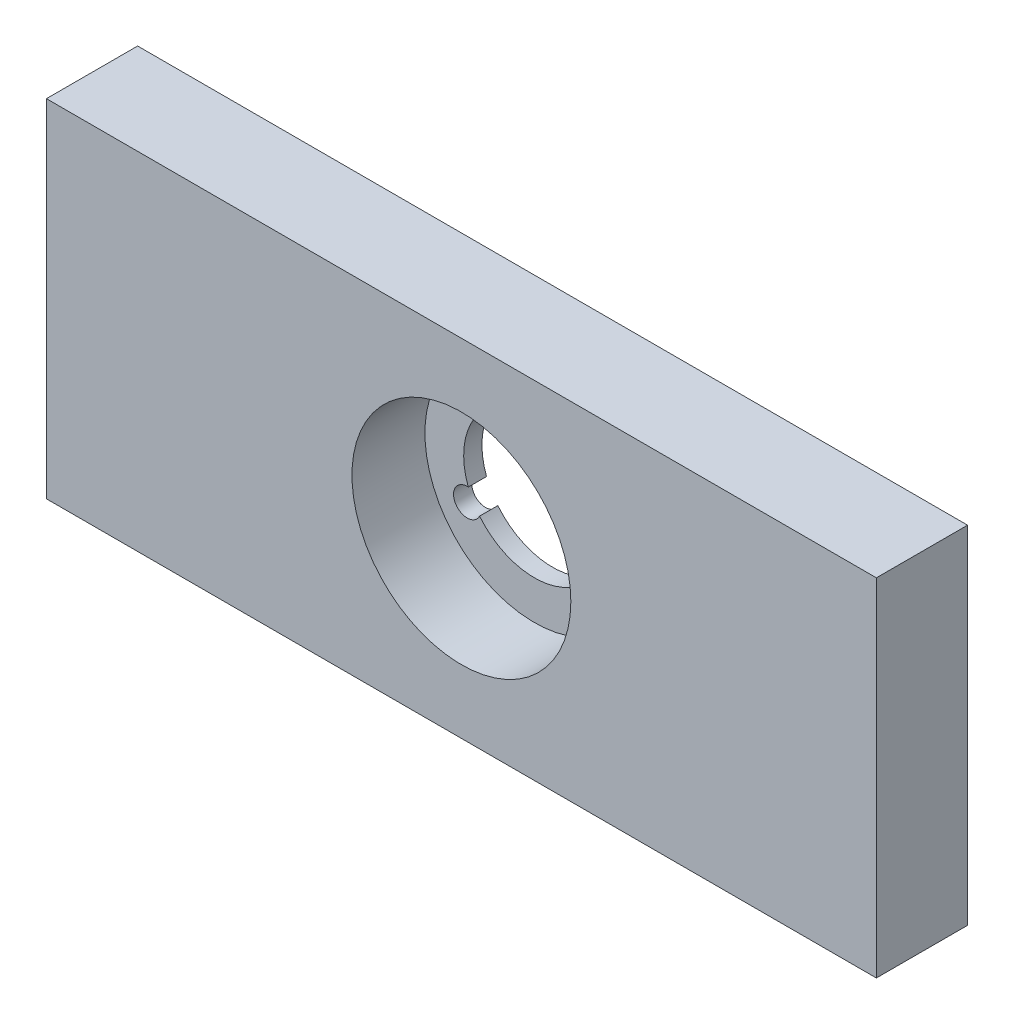
ISO-10303-21;
HEADER;
FILE_DESCRIPTION(('STEP AP214'),'2;1');
FILE_NAME('part.step','',(''),(''),'','','');
FILE_SCHEMA(('AUTOMOTIVE_DESIGN { 1 0 10303 214 1 1 1 1 }'));
ENDSEC;
DATA;
#1=APPLICATION_CONTEXT('core data for automotive mechanical design processes');
#2=APPLICATION_PROTOCOL_DEFINITION('international standard','automotive_design',2000,#1);
#3=PRODUCT_CONTEXT('',#1,'mechanical');
#4=PRODUCT('Part','Part','',(#3));
#5=PRODUCT_RELATED_PRODUCT_CATEGORY('part','',(#4));
#6=PRODUCT_DEFINITION_FORMATION('','',#4);
#7=PRODUCT_DEFINITION_CONTEXT('part definition',#1,'design');
#8=PRODUCT_DEFINITION('design','',#6,#7);
#9=PRODUCT_DEFINITION_SHAPE('','',#8);
#10=(LENGTH_UNIT() NAMED_UNIT(*) SI_UNIT(.MILLI.,.METRE.));
#11=(NAMED_UNIT(*) PLANE_ANGLE_UNIT() SI_UNIT($,.RADIAN.));
#12=(NAMED_UNIT(*) SI_UNIT($,.STERADIAN.) SOLID_ANGLE_UNIT());
#13=UNCERTAINTY_MEASURE_WITH_UNIT(LENGTH_MEASURE(1.E-05),#10,'distance_accuracy_value','');
#14=(GEOMETRIC_REPRESENTATION_CONTEXT(3) GLOBAL_UNCERTAINTY_ASSIGNED_CONTEXT((#13)) GLOBAL_UNIT_ASSIGNED_CONTEXT((#10,
#11,#12)) REPRESENTATION_CONTEXT('',''));
#15=CARTESIAN_POINT('',(0.,0.,0.));
#16=DIRECTION('',(0.,0.,1.));
#17=DIRECTION('',(1.,0.,0.));
#18=AXIS2_PLACEMENT_3D('',#15,#16,#17);
#19=CARTESIAN_POINT('',(45.5,-19.,10.));
#20=DIRECTION('',(0.,0.,-1.));
#21=DIRECTION('',(-1.,0.,0.));
#22=AXIS2_PLACEMENT_3D('',#19,#20,#21);
#23=CYLINDRICAL_SURFACE('',#22,7.75);
#24=DIRECTION('',(0.,0.,-1.));
#25=VECTOR('',#24,1.);
#26=CARTESIAN_POINT('',(52.7439441639615,-21.7545912490619,10.));
#27=LINE('',#26,#25);
#28=CARTESIAN_POINT('',(52.7439441639615,-21.7545912490619,2.));
#29=VERTEX_POINT('',#28);
#30=CARTESIAN_POINT('',(52.7439441639615,-21.7545912490619,0.));
#31=VERTEX_POINT('',#30);
#32=EDGE_CURVE('E51',#29,#31,#27,.T.);
#33=ORIENTED_EDGE('',*,*,#32,.F.);
#34=CARTESIAN_POINT('',(45.5,-19.,2.));
#35=DIRECTION('',(0.,0.,1.));
#36=DIRECTION('',(1.,0.,0.));
#37=AXIS2_PLACEMENT_3D('',#34,#35,#36);
#38=CIRCLE('',#37,7.75);
#39=CARTESIAN_POINT('',(46.7364260832507,-11.3492647058823,2.));
#40=VERTEX_POINT('',#39);
#41=EDGE_CURVE('E45',#29,#40,#38,.T.);
#42=ORIENTED_EDGE('',*,*,#41,.T.);
#43=DIRECTION('',(0.,0.,-1.));
#44=VECTOR('',#43,1.);
#45=CARTESIAN_POINT('',(46.7364260832507,-11.3492647058823,10.));
#46=LINE('',#45,#44);
#47=CARTESIAN_POINT('',(46.7364260832507,-11.3492647058823,0.));
#48=VERTEX_POINT('',#47);
#49=EDGE_CURVE('E132',#40,#48,#46,.T.);
#50=ORIENTED_EDGE('',*,*,#49,.T.);
#51=CARTESIAN_POINT('',(45.5,-19.,0.));
#52=DIRECTION('',(0.,0.,1.));
#53=DIRECTION('',(1.,0.,0.));
#54=AXIS2_PLACEMENT_3D('',#51,#52,#53);
#55=CIRCLE('',#54,7.75);
#56=EDGE_CURVE('E320',#31,#48,#55,.T.);
#57=ORIENTED_EDGE('',*,*,#56,.F.);
#58=EDGE_LOOP('',(#33,#42,#50,#57));
#59=FACE_BOUND('',#58,.T.);
#60=ADVANCED_FACE('F30',(#59),#23,.F.);
#61=CARTESIAN_POINT('',(45.5,-10.5,10.));
#62=DIRECTION('',(0.,0.,-1.));
#63=DIRECTION('',(-1.,0.,0.));
#64=AXIS2_PLACEMENT_3D('',#61,#62,#63);
#65=CYLINDRICAL_SURFACE('',#64,1.5);
#66=ORIENTED_EDGE('',*,*,#49,.F.);
#67=CARTESIAN_POINT('',(45.5,-10.5,2.));
#68=DIRECTION('',(0.,0.,1.));
#69=DIRECTION('',(1.,0.,0.));
#70=AXIS2_PLACEMENT_3D('',#67,#68,#69);
#71=CIRCLE('',#70,1.5);
#72=CARTESIAN_POINT('',(44.2635739167493,-11.3492647058823,2.));
#73=VERTEX_POINT('',#72);
#74=EDGE_CURVE('E316',#40,#73,#71,.T.);
#75=ORIENTED_EDGE('',*,*,#74,.T.);
#76=DIRECTION('',(0.,0.,-1.));
#77=VECTOR('',#76,1.);
#78=CARTESIAN_POINT('',(44.2635739167493,-11.3492647058823,10.));
#79=LINE('',#78,#77);
#80=CARTESIAN_POINT('',(44.2635739167493,-11.3492647058823,0.));
#81=VERTEX_POINT('',#80);
#82=EDGE_CURVE('E130',#73,#81,#79,.T.);
#83=ORIENTED_EDGE('',*,*,#82,.T.);
#84=CARTESIAN_POINT('',(45.5,-10.5,0.));
#85=DIRECTION('',(0.,0.,1.));
#86=DIRECTION('',(1.,0.,0.));
#87=AXIS2_PLACEMENT_3D('',#84,#85,#86);
#88=CIRCLE('',#87,1.5);
#89=EDGE_CURVE('E323',#48,#81,#88,.T.);
#90=ORIENTED_EDGE('',*,*,#89,.F.);
#91=EDGE_LOOP('',(#66,#75,#83,#90));
#92=FACE_BOUND('',#91,.T.);
#93=ADVANCED_FACE('F195',(#92),#65,.F.);
#94=CARTESIAN_POINT('',(45.5,-19.,10.));
#95=DIRECTION('',(0.,0.,-1.));
#96=DIRECTION('',(-1.,0.,0.));
#97=AXIS2_PLACEMENT_3D('',#94,#95,#96);
#98=CYLINDRICAL_SURFACE('',#97,7.75);
#99=ORIENTED_EDGE('',*,*,#82,.F.);
#100=CARTESIAN_POINT('',(45.5,-19.,2.));
#101=DIRECTION('',(0.,0.,1.));
#102=DIRECTION('',(1.,0.,0.));
#103=AXIS2_PLACEMENT_3D('',#100,#101,#102);
#104=CIRCLE('',#103,7.75);
#105=CARTESIAN_POINT('',(38.2560558360386,-21.7545912490621,2.));
#106=VERTEX_POINT('',#105);
#107=EDGE_CURVE('E313',#73,#106,#104,.T.);
#108=ORIENTED_EDGE('',*,*,#107,.T.);
#109=DIRECTION('',(0.,0.,-1.));
#110=VECTOR('',#109,1.);
#111=CARTESIAN_POINT('',(38.2560558360386,-21.7545912490621,10.));
#112=LINE('',#111,#110);
#113=CARTESIAN_POINT('',(38.2560558360386,-21.7545912490621,0.));
#114=VERTEX_POINT('',#113);
#115=EDGE_CURVE('E124',#106,#114,#112,.T.);
#116=ORIENTED_EDGE('',*,*,#115,.T.);
#117=CARTESIAN_POINT('',(45.5,-19.,0.));
#118=DIRECTION('',(0.,0.,1.));
#119=DIRECTION('',(1.,0.,0.));
#120=AXIS2_PLACEMENT_3D('',#117,#118,#119);
#121=CIRCLE('',#120,7.75);
#122=EDGE_CURVE('E326',#81,#114,#121,.T.);
#123=ORIENTED_EDGE('',*,*,#122,.F.);
#124=EDGE_LOOP('',(#99,#108,#116,#123));
#125=FACE_BOUND('',#124,.T.);
#126=ADVANCED_FACE('F200',(#125),#98,.F.);
#127=CARTESIAN_POINT('',(38.1387840678324,-23.25,10.));
#128=DIRECTION('',(0.,0.,-1.));
#129=DIRECTION('',(-1.,0.,0.));
#130=AXIS2_PLACEMENT_3D('',#127,#128,#129);
#131=CYLINDRICAL_SURFACE('',#130,1.5);
#132=ORIENTED_EDGE('',*,*,#115,.F.);
#133=CARTESIAN_POINT('',(38.1387840678324,-23.25,2.));
#134=DIRECTION('',(0.,0.,1.));
#135=DIRECTION('',(1.,0.,0.));
#136=AXIS2_PLACEMENT_3D('',#133,#134,#135);
#137=CIRCLE('',#136,1.5);
#138=CARTESIAN_POINT('',(39.4924819192893,-23.8961440450557,2.));
#139=VERTEX_POINT('',#138);
#140=EDGE_CURVE('E116',#106,#139,#137,.T.);
#141=ORIENTED_EDGE('',*,*,#140,.T.);
#142=DIRECTION('',(0.,0.,-1.));
#143=VECTOR('',#142,1.);
#144=CARTESIAN_POINT('',(39.4924819192893,-23.8961440450557,10.));
#145=LINE('',#144,#143);
#146=CARTESIAN_POINT('',(39.4924819192893,-23.8961440450557,0.));
#147=VERTEX_POINT('',#146);
#148=EDGE_CURVE('E115',#139,#147,#145,.T.);
#149=ORIENTED_EDGE('',*,*,#148,.T.);
#150=CARTESIAN_POINT('',(38.1387840678324,-23.25,0.));
#151=DIRECTION('',(0.,0.,1.));
#152=DIRECTION('',(1.,0.,0.));
#153=AXIS2_PLACEMENT_3D('',#150,#151,#152);
#154=CIRCLE('',#153,1.5);
#155=EDGE_CURVE('E329',#114,#147,#154,.T.);
#156=ORIENTED_EDGE('',*,*,#155,.F.);
#157=EDGE_LOOP('',(#132,#141,#149,#156));
#158=FACE_BOUND('',#157,.T.);
#159=ADVANCED_FACE('F206',(#158),#131,.F.);
#160=CARTESIAN_POINT('',(45.5,-19.,10.));
#161=DIRECTION('',(0.,0.,-1.));
#162=DIRECTION('',(-1.,0.,0.));
#163=AXIS2_PLACEMENT_3D('',#160,#161,#162);
#164=CYLINDRICAL_SURFACE('',#163,7.75);
#165=ORIENTED_EDGE('',*,*,#148,.F.);
#166=CARTESIAN_POINT('',(45.5,-19.,2.));
#167=DIRECTION('',(0.,0.,1.));
#168=DIRECTION('',(1.,0.,0.));
#169=AXIS2_PLACEMENT_3D('',#166,#167,#168);
#170=CIRCLE('',#169,7.75);
#171=CARTESIAN_POINT('',(51.5075180807109,-23.8961440450554,2.));
#172=VERTEX_POINT('',#171);
#173=EDGE_CURVE('E107',#139,#172,#170,.T.);
#174=ORIENTED_EDGE('',*,*,#173,.T.);
#175=DIRECTION('',(0.,0.,-1.));
#176=VECTOR('',#175,1.);
#177=CARTESIAN_POINT('',(51.5075180807109,-23.8961440450554,10.));
#178=LINE('',#177,#176);
#179=CARTESIAN_POINT('',(51.5075180807109,-23.8961440450554,0.));
#180=VERTEX_POINT('',#179);
#181=EDGE_CURVE('E114',#172,#180,#178,.T.);
#182=ORIENTED_EDGE('',*,*,#181,.T.);
#183=CARTESIAN_POINT('',(45.5,-19.,0.));
#184=DIRECTION('',(0.,0.,1.));
#185=DIRECTION('',(1.,0.,0.));
#186=AXIS2_PLACEMENT_3D('',#183,#184,#185);
#187=CIRCLE('',#186,7.75);
#188=EDGE_CURVE('E332',#147,#180,#187,.T.);
#189=ORIENTED_EDGE('',*,*,#188,.F.);
#190=EDGE_LOOP('',(#165,#174,#182,#189));
#191=FACE_BOUND('',#190,.T.);
#192=ADVANCED_FACE('F112',(#191),#164,.F.);
#193=CARTESIAN_POINT('',(52.8612159321678,-23.2499999999999,10.));
#194=DIRECTION('',(0.,0.,-1.));
#195=DIRECTION('',(-1.,0.,0.));
#196=AXIS2_PLACEMENT_3D('',#193,#194,#195);
#197=CYLINDRICAL_SURFACE('',#196,1.5);
#198=ORIENTED_EDGE('',*,*,#181,.F.);
#199=CARTESIAN_POINT('',(52.8612159321678,-23.2499999999999,2.));
#200=DIRECTION('',(0.,0.,1.));
#201=DIRECTION('',(1.,0.,0.));
#202=AXIS2_PLACEMENT_3D('',#199,#200,#201);
#203=CIRCLE('',#202,1.5);
#204=EDGE_CURVE('E11',#172,#29,#203,.T.);
#205=ORIENTED_EDGE('',*,*,#204,.T.);
#206=ORIENTED_EDGE('',*,*,#32,.T.);
#207=CARTESIAN_POINT('',(52.8612159321678,-23.2499999999999,0.));
#208=DIRECTION('',(0.,0.,1.));
#209=DIRECTION('',(1.,0.,0.));
#210=AXIS2_PLACEMENT_3D('',#207,#208,#209);
#211=CIRCLE('',#210,1.5);
#212=EDGE_CURVE('E121',#180,#31,#211,.T.);
#213=ORIENTED_EDGE('',*,*,#212,.F.);
#214=EDGE_LOOP('',(#198,#205,#206,#213));
#215=FACE_BOUND('',#214,.T.);
#216=ADVANCED_FACE('F119',(#215),#197,.F.);
#217=CARTESIAN_POINT('',(0.,0.,10.));
#218=DIRECTION('',(0.,0.,-1.));
#219=DIRECTION('',(-1.,0.,0.));
#220=AXIS2_PLACEMENT_3D('',#217,#218,#219);
#221=PLANE('',#220);
#222=CARTESIAN_POINT('',(45.5,-19.,10.));
#223=DIRECTION('',(0.,0.,1.));
#224=DIRECTION('',(1.,0.,0.));
#225=AXIS2_PLACEMENT_3D('',#222,#223,#224);
#226=CIRCLE('',#225,12.);
#227=CARTESIAN_POINT('',(57.5,-19.,10.));
#228=VERTEX_POINT('',#227);
#229=EDGE_CURVE('E308',#228,#228,#226,.T.);
#230=ORIENTED_EDGE('',*,*,#229,.F.);
#231=EDGE_LOOP('',(#230));
#232=FACE_BOUND('',#231,.T.);
#233=DIRECTION('',(0.,-1.,0.));
#234=VECTOR('',#233,1.);
#235=CARTESIAN_POINT('',(0.,-38.,10.));
#236=LINE('',#235,#234);
#237=CARTESIAN_POINT('',(0.,0.,10.));
#238=VERTEX_POINT('',#237);
#239=CARTESIAN_POINT('',(0.,-38.,10.));
#240=VERTEX_POINT('',#239);
#241=EDGE_CURVE('E135',#238,#240,#236,.T.);
#242=ORIENTED_EDGE('',*,*,#241,.T.);
#243=DIRECTION('',(1.,0.,0.));
#244=VECTOR('',#243,1.);
#245=CARTESIAN_POINT('',(91.,-38.,10.));
#246=LINE('',#245,#244);
#247=CARTESIAN_POINT('',(91.,-38.,10.));
#248=VERTEX_POINT('',#247);
#249=EDGE_CURVE('E138',#240,#248,#246,.T.);
#250=ORIENTED_EDGE('',*,*,#249,.T.);
#251=DIRECTION('',(0.,1.,0.));
#252=VECTOR('',#251,1.);
#253=CARTESIAN_POINT('',(91.,0.,10.));
#254=LINE('',#253,#252);
#255=CARTESIAN_POINT('',(91.,0.,10.));
#256=VERTEX_POINT('',#255);
#257=EDGE_CURVE('E141',#248,#256,#254,.T.);
#258=ORIENTED_EDGE('',*,*,#257,.T.);
#259=DIRECTION('',(-1.,0.,0.));
#260=VECTOR('',#259,1.);
#261=CARTESIAN_POINT('',(0.,0.,10.));
#262=LINE('',#261,#260);
#263=EDGE_CURVE('E143',#256,#238,#262,.T.);
#264=ORIENTED_EDGE('',*,*,#263,.T.);
#265=EDGE_LOOP('',(#242,#250,#258,#264));
#266=FACE_BOUND('',#265,.T.);
#267=ADVANCED_FACE('F182',(#232,#266),#221,.F.);
#268=CARTESIAN_POINT('',(0.,0.,0.));
#269=DIRECTION('',(0.,0.,-1.));
#270=DIRECTION('',(-1.,0.,0.));
#271=AXIS2_PLACEMENT_3D('',#268,#269,#270);
#272=PLANE('',#271);
#273=DIRECTION('',(0.,-1.,0.));
#274=VECTOR('',#273,1.);
#275=CARTESIAN_POINT('',(0.,-38.,0.));
#276=LINE('',#275,#274);
#277=CARTESIAN_POINT('',(0.,0.,0.));
#278=VERTEX_POINT('',#277);
#279=CARTESIAN_POINT('',(0.,-38.,0.));
#280=VERTEX_POINT('',#279);
#281=EDGE_CURVE('E134',#278,#280,#276,.T.);
#282=ORIENTED_EDGE('',*,*,#281,.F.);
#283=DIRECTION('',(-1.,0.,0.));
#284=VECTOR('',#283,1.);
#285=CARTESIAN_POINT('',(0.,0.,0.));
#286=LINE('',#285,#284);
#287=CARTESIAN_POINT('',(91.,0.,0.));
#288=VERTEX_POINT('',#287);
#289=EDGE_CURVE('E139',#288,#278,#286,.T.);
#290=ORIENTED_EDGE('',*,*,#289,.F.);
#291=DIRECTION('',(0.,1.,0.));
#292=VECTOR('',#291,1.);
#293=CARTESIAN_POINT('',(91.,0.,0.));
#294=LINE('',#293,#292);
#295=CARTESIAN_POINT('',(91.,-38.,0.));
#296=VERTEX_POINT('',#295);
#297=EDGE_CURVE('E150',#296,#288,#294,.T.);
#298=ORIENTED_EDGE('',*,*,#297,.F.);
#299=DIRECTION('',(1.,0.,0.));
#300=VECTOR('',#299,1.);
#301=CARTESIAN_POINT('',(91.,-38.,0.));
#302=LINE('',#301,#300);
#303=EDGE_CURVE('E148',#280,#296,#302,.T.);
#304=ORIENTED_EDGE('',*,*,#303,.F.);
#305=EDGE_LOOP('',(#282,#290,#298,#304));
#306=FACE_BOUND('',#305,.T.);
#307=ORIENTED_EDGE('',*,*,#212,.T.);
#308=ORIENTED_EDGE('',*,*,#56,.T.);
#309=ORIENTED_EDGE('',*,*,#89,.T.);
#310=ORIENTED_EDGE('',*,*,#122,.T.);
#311=ORIENTED_EDGE('',*,*,#155,.T.);
#312=ORIENTED_EDGE('',*,*,#188,.T.);
#313=EDGE_LOOP('',(#307,#308,#309,#310,#311,#312));
#314=FACE_BOUND('',#313,.T.);
#315=ADVANCED_FACE('F171',(#306,#314),#272,.T.);
#316=CARTESIAN_POINT('',(0.,-38.,10.));
#317=DIRECTION('',(1.,0.,0.));
#318=DIRECTION('',(0.,0.,-1.));
#319=AXIS2_PLACEMENT_3D('',#316,#317,#318);
#320=PLANE('',#319);
#321=ORIENTED_EDGE('',*,*,#281,.T.);
#322=DIRECTION('',(0.,0.,-1.));
#323=VECTOR('',#322,1.);
#324=CARTESIAN_POINT('',(0.,-38.,10.));
#325=LINE('',#324,#323);
#326=EDGE_CURVE('E38',#240,#280,#325,.T.);
#327=ORIENTED_EDGE('',*,*,#326,.F.);
#328=ORIENTED_EDGE('',*,*,#241,.F.);
#329=DIRECTION('',(0.,0.,-1.));
#330=VECTOR('',#329,1.);
#331=CARTESIAN_POINT('',(0.,0.,10.));
#332=LINE('',#331,#330);
#333=EDGE_CURVE('E145',#238,#278,#332,.T.);
#334=ORIENTED_EDGE('',*,*,#333,.T.);
#335=EDGE_LOOP('',(#321,#327,#328,#334));
#336=FACE_BOUND('',#335,.T.);
#337=ADVANCED_FACE('F32',(#336),#320,.F.);
#338=CARTESIAN_POINT('',(91.,-38.,10.));
#339=DIRECTION('',(0.,1.,0.));
#340=DIRECTION('',(-1.,0.,0.));
#341=AXIS2_PLACEMENT_3D('',#338,#339,#340);
#342=PLANE('',#341);
#343=ORIENTED_EDGE('',*,*,#303,.T.);
#344=DIRECTION('',(0.,0.,-1.));
#345=VECTOR('',#344,1.);
#346=CARTESIAN_POINT('',(91.,-38.,10.));
#347=LINE('',#346,#345);
#348=EDGE_CURVE('E158',#248,#296,#347,.T.);
#349=ORIENTED_EDGE('',*,*,#348,.F.);
#350=ORIENTED_EDGE('',*,*,#249,.F.);
#351=ORIENTED_EDGE('',*,*,#326,.T.);
#352=EDGE_LOOP('',(#343,#349,#350,#351));
#353=FACE_BOUND('',#352,.T.);
#354=ADVANCED_FACE('F163',(#353),#342,.F.);
#355=CARTESIAN_POINT('',(91.,0.,10.));
#356=DIRECTION('',(-1.,0.,0.));
#357=DIRECTION('',(0.,0.,1.));
#358=AXIS2_PLACEMENT_3D('',#355,#356,#357);
#359=PLANE('',#358);
#360=ORIENTED_EDGE('',*,*,#297,.T.);
#361=DIRECTION('',(0.,0.,-1.));
#362=VECTOR('',#361,1.);
#363=CARTESIAN_POINT('',(91.,0.,10.));
#364=LINE('',#363,#362);
#365=EDGE_CURVE('E155',#256,#288,#364,.T.);
#366=ORIENTED_EDGE('',*,*,#365,.F.);
#367=ORIENTED_EDGE('',*,*,#257,.F.);
#368=ORIENTED_EDGE('',*,*,#348,.T.);
#369=EDGE_LOOP('',(#360,#366,#367,#368));
#370=FACE_BOUND('',#369,.T.);
#371=ADVANCED_FACE('F176',(#370),#359,.F.);
#372=CARTESIAN_POINT('',(0.,0.,10.));
#373=DIRECTION('',(0.,-1.,0.));
#374=DIRECTION('',(0.,0.,-1.));
#375=AXIS2_PLACEMENT_3D('',#372,#373,#374);
#376=PLANE('',#375);
#377=ORIENTED_EDGE('',*,*,#289,.T.);
#378=ORIENTED_EDGE('',*,*,#333,.F.);
#379=ORIENTED_EDGE('',*,*,#263,.F.);
#380=ORIENTED_EDGE('',*,*,#365,.T.);
#381=EDGE_LOOP('',(#377,#378,#379,#380));
#382=FACE_BOUND('',#381,.T.);
#383=ADVANCED_FACE('F180',(#382),#376,.F.);
#384=CARTESIAN_POINT('',(45.5,-19.,2.));
#385=DIRECTION('',(0.,0.,1.));
#386=DIRECTION('',(1.,0.,0.));
#387=AXIS2_PLACEMENT_3D('',#384,#385,#386);
#388=CYLINDRICAL_SURFACE('',#387,12.);
#389=CARTESIAN_POINT('',(45.5,-19.,2.));
#390=DIRECTION('',(0.,0.,1.));
#391=DIRECTION('',(1.,0.,0.));
#392=AXIS2_PLACEMENT_3D('',#389,#390,#391);
#393=CIRCLE('',#392,12.);
#394=CARTESIAN_POINT('',(57.5,-19.,2.));
#395=VERTEX_POINT('',#394);
#396=EDGE_CURVE('E117',#395,#395,#393,.T.);
#397=ORIENTED_EDGE('',*,*,#396,.F.);
#398=EDGE_LOOP('',(#397));
#399=FACE_BOUND('',#398,.T.);
#400=ORIENTED_EDGE('',*,*,#229,.T.);
#401=EDGE_LOOP('',(#400));
#402=FACE_BOUND('',#401,.T.);
#403=ADVANCED_FACE('F213',(#399,#402),#388,.F.);
#404=CARTESIAN_POINT('',(45.5,-19.,2.));
#405=DIRECTION('',(0.,0.,1.));
#406=DIRECTION('',(1.,0.,0.));
#407=AXIS2_PLACEMENT_3D('',#404,#405,#406);
#408=PLANE('',#407);
#409=ORIENTED_EDGE('',*,*,#204,.F.);
#410=ORIENTED_EDGE('',*,*,#173,.F.);
#411=ORIENTED_EDGE('',*,*,#140,.F.);
#412=ORIENTED_EDGE('',*,*,#107,.F.);
#413=ORIENTED_EDGE('',*,*,#74,.F.);
#414=ORIENTED_EDGE('',*,*,#41,.F.);
#415=EDGE_LOOP('',(#409,#410,#411,#412,#413,#414));
#416=FACE_BOUND('',#415,.T.);
#417=ORIENTED_EDGE('',*,*,#396,.T.);
#418=EDGE_LOOP('',(#417));
#419=FACE_BOUND('',#418,.T.);
#420=ADVANCED_FACE('F105',(#416,#419),#408,.T.);
#421=CLOSED_SHELL('',(#60,#93,#126,#159,#192,#216,#267,#315,#337,#354,#371,#383,#403,#420));
#422=MANIFOLD_SOLID_BREP('B2',#421);
#423=ADVANCED_BREP_SHAPE_REPRESENTATION('',(#18,#422),#14);
#424=SHAPE_DEFINITION_REPRESENTATION(#9,#423);
ENDSEC;
END-ISO-10303-21;
